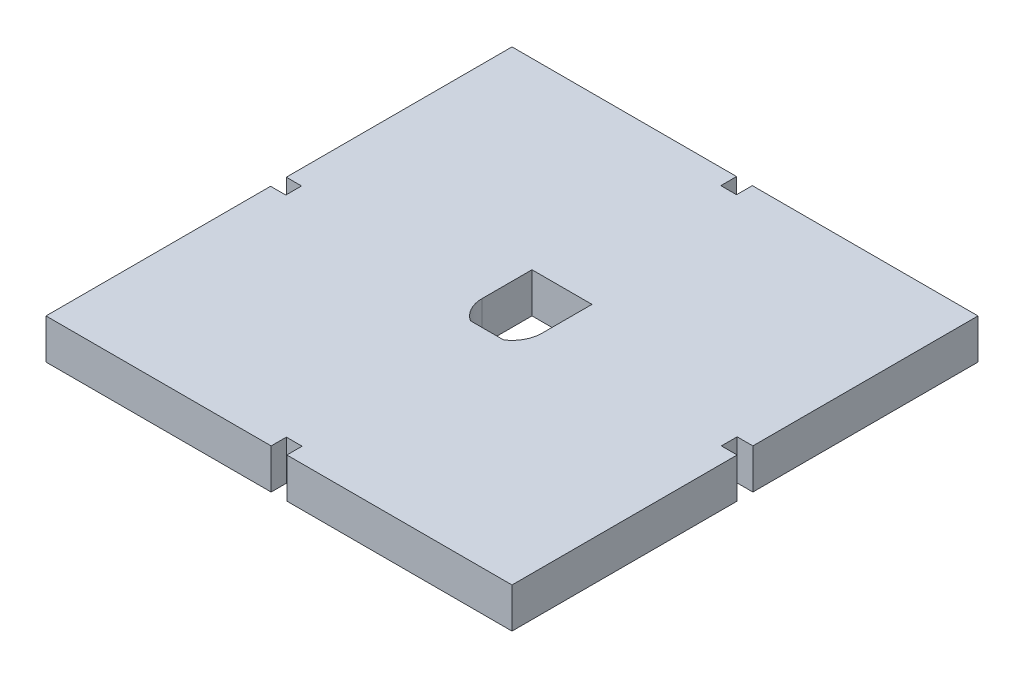
ISO-10303-21;
HEADER;
FILE_DESCRIPTION(('STEP AP214'),'2;1');
FILE_NAME('part.step','',(''),(''),'','','');
FILE_SCHEMA(('AUTOMOTIVE_DESIGN { 1 0 10303 214 1 1 1 1 }'));
ENDSEC;
DATA;
#1=APPLICATION_CONTEXT('core data for automotive mechanical design processes');
#2=APPLICATION_PROTOCOL_DEFINITION('international standard','automotive_design',2000,#1);
#3=PRODUCT_CONTEXT('',#1,'mechanical');
#4=PRODUCT('Part','Part','',(#3));
#5=PRODUCT_RELATED_PRODUCT_CATEGORY('part','',(#4));
#6=PRODUCT_DEFINITION_FORMATION('','',#4);
#7=PRODUCT_DEFINITION_CONTEXT('part definition',#1,'design');
#8=PRODUCT_DEFINITION('design','',#6,#7);
#9=PRODUCT_DEFINITION_SHAPE('','',#8);
#10=(LENGTH_UNIT() NAMED_UNIT(*) SI_UNIT(.MILLI.,.METRE.));
#11=(NAMED_UNIT(*) PLANE_ANGLE_UNIT() SI_UNIT($,.RADIAN.));
#12=(NAMED_UNIT(*) SI_UNIT($,.STERADIAN.) SOLID_ANGLE_UNIT());
#13=UNCERTAINTY_MEASURE_WITH_UNIT(LENGTH_MEASURE(1.E-05),#10,'distance_accuracy_value','');
#14=(GEOMETRIC_REPRESENTATION_CONTEXT(3) GLOBAL_UNCERTAINTY_ASSIGNED_CONTEXT((#13)) GLOBAL_UNIT_ASSIGNED_CONTEXT((#10,
#11,#12)) REPRESENTATION_CONTEXT('',''));
#15=CARTESIAN_POINT('',(0.,0.,0.));
#16=DIRECTION('',(0.,0.,1.));
#17=DIRECTION('',(1.,0.,0.));
#18=AXIS2_PLACEMENT_3D('',#15,#16,#17);
#19=CARTESIAN_POINT('',(0.,12.7,0.));
#20=DIRECTION('',(1.,0.,0.));
#21=DIRECTION('',(0.,0.,-1.));
#22=AXIS2_PLACEMENT_3D('',#19,#20,#21);
#23=PLANE('',#22);
#24=DIRECTION('',(0.,0.,1.));
#25=VECTOR('',#24,1.);
#26=CARTESIAN_POINT('',(0.,0.,0.));
#27=LINE('',#26,#25);
#28=CARTESIAN_POINT('',(0.,0.,-148.));
#29=VERTEX_POINT('',#28);
#30=CARTESIAN_POINT('',(0.,0.,-76.3207871455941));
#31=VERTEX_POINT('',#30);
#32=EDGE_CURVE('E438',#29,#31,#27,.T.);
#33=ORIENTED_EDGE('',*,*,#32,.T.);
#34=DIRECTION('',(0.,1.,0.));
#35=VECTOR('',#34,1.);
#36=CARTESIAN_POINT('',(0.,12.7,-76.3207871455941));
#37=LINE('',#36,#35);
#38=CARTESIAN_POINT('',(0.,12.7,-76.3207871455941));
#39=VERTEX_POINT('',#38);
#40=EDGE_CURVE('E308',#31,#39,#37,.T.);
#41=ORIENTED_EDGE('',*,*,#40,.T.);
#42=DIRECTION('',(0.,0.,1.));
#43=VECTOR('',#42,1.);
#44=CARTESIAN_POINT('',(0.,12.7,0.));
#45=LINE('',#44,#43);
#46=CARTESIAN_POINT('',(0.,12.7,-148.));
#47=VERTEX_POINT('',#46);
#48=EDGE_CURVE('E417',#47,#39,#45,.T.);
#49=ORIENTED_EDGE('',*,*,#48,.F.);
#50=DIRECTION('',(0.,-1.,0.));
#51=VECTOR('',#50,1.);
#52=CARTESIAN_POINT('',(0.,12.7,-148.));
#53=LINE('',#52,#51);
#54=EDGE_CURVE('E437',#47,#29,#53,.T.);
#55=ORIENTED_EDGE('',*,*,#54,.T.);
#56=EDGE_LOOP('',(#33,#41,#49,#55));
#57=FACE_BOUND('',#56,.T.);
#58=ADVANCED_FACE('F39',(#57),#23,.F.);
#59=CARTESIAN_POINT('',(0.,12.7,0.));
#60=DIRECTION('',(0.,0.,-1.));
#61=DIRECTION('',(-1.,0.,0.));
#62=AXIS2_PLACEMENT_3D('',#59,#60,#61);
#63=PLANE('',#62);
#64=DIRECTION('',(1.,0.,0.));
#65=VECTOR('',#64,1.);
#66=CARTESIAN_POINT('',(0.,0.,0.));
#67=LINE('',#66,#65);
#68=CARTESIAN_POINT('',(0.,0.,0.));
#69=VERTEX_POINT('',#68);
#70=CARTESIAN_POINT('',(71.5062552749679,0.,0.));
#71=VERTEX_POINT('',#70);
#72=EDGE_CURVE('E443',#69,#71,#67,.T.);
#73=ORIENTED_EDGE('',*,*,#72,.T.);
#74=DIRECTION('',(0.,1.,0.));
#75=VECTOR('',#74,1.);
#76=CARTESIAN_POINT('',(71.5062552749679,12.7,0.));
#77=LINE('',#76,#75);
#78=CARTESIAN_POINT('',(71.5062552749679,12.7,0.));
#79=VERTEX_POINT('',#78);
#80=EDGE_CURVE('E300',#71,#79,#77,.T.);
#81=ORIENTED_EDGE('',*,*,#80,.T.);
#82=DIRECTION('',(1.,0.,0.));
#83=VECTOR('',#82,1.);
#84=CARTESIAN_POINT('',(0.,12.7,0.));
#85=LINE('',#84,#83);
#86=CARTESIAN_POINT('',(0.,12.7,0.));
#87=VERTEX_POINT('',#86);
#88=EDGE_CURVE('E423',#87,#79,#85,.T.);
#89=ORIENTED_EDGE('',*,*,#88,.F.);
#90=DIRECTION('',(0.,-1.,0.));
#91=VECTOR('',#90,1.);
#92=CARTESIAN_POINT('',(0.,12.7,0.));
#93=LINE('',#92,#91);
#94=EDGE_CURVE('E467',#87,#69,#93,.T.);
#95=ORIENTED_EDGE('',*,*,#94,.T.);
#96=EDGE_LOOP('',(#73,#81,#89,#95));
#97=FACE_BOUND('',#96,.T.);
#98=ADVANCED_FACE('F521',(#97),#63,.F.);
#99=CARTESIAN_POINT('',(0.,12.7,-148.));
#100=DIRECTION('',(0.,0.,1.));
#101=DIRECTION('',(1.,0.,0.));
#102=AXIS2_PLACEMENT_3D('',#99,#100,#101);
#103=PLANE('',#102);
#104=DIRECTION('',(-1.,0.,0.));
#105=VECTOR('',#104,1.);
#106=CARTESIAN_POINT('',(0.,0.,-148.));
#107=LINE('',#106,#105);
#108=CARTESIAN_POINT('',(148.,0.,-148.));
#109=VERTEX_POINT('',#108);
#110=CARTESIAN_POINT('',(76.3270424205609,0.,-148.));
#111=VERTEX_POINT('',#110);
#112=EDGE_CURVE('E453',#109,#111,#107,.T.);
#113=ORIENTED_EDGE('',*,*,#112,.T.);
#114=DIRECTION('',(0.,1.,0.));
#115=VECTOR('',#114,1.);
#116=CARTESIAN_POINT('',(76.3270424205609,12.7,-148.));
#117=LINE('',#116,#115);
#118=CARTESIAN_POINT('',(76.3270424205609,12.7,-148.));
#119=VERTEX_POINT('',#118);
#120=EDGE_CURVE('E227',#111,#119,#117,.T.);
#121=ORIENTED_EDGE('',*,*,#120,.T.);
#122=DIRECTION('',(-1.,0.,0.));
#123=VECTOR('',#122,1.);
#124=CARTESIAN_POINT('',(0.,12.7,-148.));
#125=LINE('',#124,#123);
#126=CARTESIAN_POINT('',(148.,12.7,-148.));
#127=VERTEX_POINT('',#126);
#128=EDGE_CURVE('E433',#127,#119,#125,.T.);
#129=ORIENTED_EDGE('',*,*,#128,.F.);
#130=DIRECTION('',(0.,-1.,0.));
#131=VECTOR('',#130,1.);
#132=CARTESIAN_POINT('',(148.,12.7,-148.));
#133=LINE('',#132,#131);
#134=EDGE_CURVE('E459',#127,#109,#133,.T.);
#135=ORIENTED_EDGE('',*,*,#134,.T.);
#136=EDGE_LOOP('',(#113,#121,#129,#135));
#137=FACE_BOUND('',#136,.T.);
#138=ADVANCED_FACE('F525',(#137),#103,.F.);
#139=CARTESIAN_POINT('',(148.,12.7,0.));
#140=DIRECTION('',(-1.,0.,0.));
#141=DIRECTION('',(0.,0.,1.));
#142=AXIS2_PLACEMENT_3D('',#139,#140,#141);
#143=PLANE('',#142);
#144=DIRECTION('',(0.,0.,-1.));
#145=VECTOR('',#144,1.);
#146=CARTESIAN_POINT('',(148.,0.,0.));
#147=LINE('',#146,#145);
#148=CARTESIAN_POINT('',(148.,0.,0.));
#149=VERTEX_POINT('',#148);
#150=CARTESIAN_POINT('',(148.,0.,-71.5));
#151=VERTEX_POINT('',#150);
#152=EDGE_CURVE('E448',#149,#151,#147,.T.);
#153=ORIENTED_EDGE('',*,*,#152,.T.);
#154=DIRECTION('',(0.,1.,0.));
#155=VECTOR('',#154,1.);
#156=CARTESIAN_POINT('',(148.,12.7,-71.5));
#157=LINE('',#156,#155);
#158=CARTESIAN_POINT('',(148.,12.7,-71.5));
#159=VERTEX_POINT('',#158);
#160=EDGE_CURVE('E347',#151,#159,#157,.T.);
#161=ORIENTED_EDGE('',*,*,#160,.T.);
#162=DIRECTION('',(0.,0.,-1.));
#163=VECTOR('',#162,1.);
#164=CARTESIAN_POINT('',(148.,12.7,0.));
#165=LINE('',#164,#163);
#166=CARTESIAN_POINT('',(148.,12.7,0.));
#167=VERTEX_POINT('',#166);
#168=EDGE_CURVE('E428',#167,#159,#165,.T.);
#169=ORIENTED_EDGE('',*,*,#168,.F.);
#170=DIRECTION('',(0.,-1.,0.));
#171=VECTOR('',#170,1.);
#172=CARTESIAN_POINT('',(148.,12.7,0.));
#173=LINE('',#172,#171);
#174=EDGE_CURVE('E463',#167,#149,#173,.T.);
#175=ORIENTED_EDGE('',*,*,#174,.T.);
#176=EDGE_LOOP('',(#153,#161,#169,#175));
#177=FACE_BOUND('',#176,.T.);
#178=ADVANCED_FACE('F529',(#177),#143,.F.);
#179=CARTESIAN_POINT('',(0.,12.7,-71.3207871455941));
#180=VERTEX_POINT('',#179);
#181=EDGE_CURVE('E422',#180,#87,#45,.T.);
#182=ORIENTED_EDGE('',*,*,#181,.F.);
#183=DIRECTION('',(0.,-1.,0.));
#184=VECTOR('',#183,1.);
#185=CARTESIAN_POINT('',(0.,12.7,-71.3207871455941));
#186=LINE('',#185,#184);
#187=CARTESIAN_POINT('',(0.,0.,-71.3207871455941));
#188=VERTEX_POINT('',#187);
#189=EDGE_CURVE('E304',#180,#188,#186,.T.);
#190=ORIENTED_EDGE('',*,*,#189,.T.);
#191=EDGE_CURVE('E401',#188,#69,#27,.T.);
#192=ORIENTED_EDGE('',*,*,#191,.T.);
#193=ORIENTED_EDGE('',*,*,#94,.F.);
#194=EDGE_LOOP('',(#182,#190,#192,#193));
#195=FACE_BOUND('',#194,.T.);
#196=ADVANCED_FACE('F41',(#195),#23,.F.);
#197=CARTESIAN_POINT('',(76.5062552749679,12.7,0.));
#198=VERTEX_POINT('',#197);
#199=EDGE_CURVE('E421',#198,#167,#85,.T.);
#200=ORIENTED_EDGE('',*,*,#199,.F.);
#201=DIRECTION('',(0.,-1.,0.));
#202=VECTOR('',#201,1.);
#203=CARTESIAN_POINT('',(76.5062552749679,12.7,0.));
#204=LINE('',#203,#202);
#205=CARTESIAN_POINT('',(76.5062552749679,0.,0.));
#206=VERTEX_POINT('',#205);
#207=EDGE_CURVE('E220',#198,#206,#204,.T.);
#208=ORIENTED_EDGE('',*,*,#207,.T.);
#209=EDGE_CURVE('E442',#206,#149,#67,.T.);
#210=ORIENTED_EDGE('',*,*,#209,.T.);
#211=ORIENTED_EDGE('',*,*,#174,.F.);
#212=EDGE_LOOP('',(#200,#208,#210,#211));
#213=FACE_BOUND('',#212,.T.);
#214=ADVANCED_FACE('F527',(#213),#63,.F.);
#215=CARTESIAN_POINT('',(148.,12.7,-76.5));
#216=VERTEX_POINT('',#215);
#217=EDGE_CURVE('E427',#216,#127,#165,.T.);
#218=ORIENTED_EDGE('',*,*,#217,.F.);
#219=DIRECTION('',(0.,-1.,0.));
#220=VECTOR('',#219,1.);
#221=CARTESIAN_POINT('',(148.,12.7,-76.5));
#222=LINE('',#221,#220);
#223=CARTESIAN_POINT('',(148.,0.,-76.5));
#224=VERTEX_POINT('',#223);
#225=EDGE_CURVE('E340',#216,#224,#222,.T.);
#226=ORIENTED_EDGE('',*,*,#225,.T.);
#227=EDGE_CURVE('E447',#224,#109,#147,.T.);
#228=ORIENTED_EDGE('',*,*,#227,.T.);
#229=ORIENTED_EDGE('',*,*,#134,.F.);
#230=EDGE_LOOP('',(#218,#226,#228,#229));
#231=FACE_BOUND('',#230,.T.);
#232=ADVANCED_FACE('F534',(#231),#143,.F.);
#233=CARTESIAN_POINT('',(71.3270424205609,12.7,-148.));
#234=VERTEX_POINT('',#233);
#235=EDGE_CURVE('E432',#234,#47,#125,.T.);
#236=ORIENTED_EDGE('',*,*,#235,.F.);
#237=DIRECTION('',(0.,-1.,0.));
#238=VECTOR('',#237,1.);
#239=CARTESIAN_POINT('',(71.3270424205609,12.7,-148.));
#240=LINE('',#239,#238);
#241=CARTESIAN_POINT('',(71.3270424205609,0.,-148.));
#242=VERTEX_POINT('',#241);
#243=EDGE_CURVE('E312',#234,#242,#240,.T.);
#244=ORIENTED_EDGE('',*,*,#243,.T.);
#245=EDGE_CURVE('E452',#242,#29,#107,.T.);
#246=ORIENTED_EDGE('',*,*,#245,.T.);
#247=ORIENTED_EDGE('',*,*,#54,.F.);
#248=EDGE_LOOP('',(#236,#244,#246,#247));
#249=FACE_BOUND('',#248,.T.);
#250=ADVANCED_FACE('F502',(#249),#103,.F.);
#251=CARTESIAN_POINT('',(0.,12.7,0.));
#252=DIRECTION('',(0.,-1.,0.));
#253=DIRECTION('',(0.,0.,-1.));
#254=AXIS2_PLACEMENT_3D('',#251,#252,#253);
#255=PLANE('',#254);
#256=DIRECTION('',(1.,0.,0.));
#257=VECTOR('',#256,1.);
#258=CARTESIAN_POINT('',(0.,12.7,-66.0625));
#259=LINE('',#258,#257);
#260=CARTESIAN_POINT('',(68.7348581453108,12.7,-66.0625));
#261=VERTEX_POINT('',#260);
#262=CARTESIAN_POINT('',(79.2651418546892,12.7,-66.0625));
#263=VERTEX_POINT('',#262);
#264=EDGE_CURVE('E379',#261,#263,#259,.T.);
#265=ORIENTED_EDGE('',*,*,#264,.F.);
#266=CARTESIAN_POINT('',(74.,12.7,-74.));
#267=DIRECTION('',(0.,1.,0.));
#268=DIRECTION('',(0.,0.,1.));
#269=AXIS2_PLACEMENT_3D('',#266,#267,#268);
#270=CIRCLE('',#269,9.52500000000001);
#271=CARTESIAN_POINT('',(64.475,12.7,-74.));
#272=VERTEX_POINT('',#271);
#273=EDGE_CURVE('E351',#272,#261,#270,.T.);
#274=ORIENTED_EDGE('',*,*,#273,.F.);
#275=DIRECTION('',(0.,0.,-1.));
#276=VECTOR('',#275,1.);
#277=CARTESIAN_POINT('',(64.475,12.7,0.));
#278=LINE('',#277,#276);
#279=CARTESIAN_POINT('',(64.475,12.7,-89.875));
#280=VERTEX_POINT('',#279);
#281=EDGE_CURVE('E357',#272,#280,#278,.T.);
#282=ORIENTED_EDGE('',*,*,#281,.T.);
#283=DIRECTION('',(-1.,0.,0.));
#284=VECTOR('',#283,1.);
#285=CARTESIAN_POINT('',(0.,12.7,-89.875));
#286=LINE('',#285,#284);
#287=CARTESIAN_POINT('',(83.525,12.7,-89.875));
#288=VERTEX_POINT('',#287);
#289=EDGE_CURVE('E391',#288,#280,#286,.T.);
#290=ORIENTED_EDGE('',*,*,#289,.F.);
#291=DIRECTION('',(0.,0.,-1.));
#292=VECTOR('',#291,1.);
#293=CARTESIAN_POINT('',(83.525,12.7,0.));
#294=LINE('',#293,#292);
#295=CARTESIAN_POINT('',(83.525,12.7,-74.));
#296=VERTEX_POINT('',#295);
#297=EDGE_CURVE('E387',#296,#288,#294,.T.);
#298=ORIENTED_EDGE('',*,*,#297,.F.);
#299=CARTESIAN_POINT('',(74.,12.7,-74.));
#300=DIRECTION('',(0.,1.,0.));
#301=DIRECTION('',(0.,0.,1.));
#302=AXIS2_PLACEMENT_3D('',#299,#300,#301);
#303=CIRCLE('',#302,9.52500000000001);
#304=EDGE_CURVE('E383',#263,#296,#303,.T.);
#305=ORIENTED_EDGE('',*,*,#304,.F.);
#306=EDGE_LOOP('',(#265,#274,#282,#290,#298,#305));
#307=FACE_BOUND('',#306,.T.);
#308=ORIENTED_EDGE('',*,*,#128,.T.);
#309=DIRECTION('',(0.,0.,-1.));
#310=VECTOR('',#309,1.);
#311=CARTESIAN_POINT('',(76.3270424205609,12.7,-142.993744725033));
#312=LINE('',#311,#310);
#313=CARTESIAN_POINT('',(76.3270424205609,12.7,-142.993744725033));
#314=VERTEX_POINT('',#313);
#315=EDGE_CURVE('E238',#314,#119,#312,.T.);
#316=ORIENTED_EDGE('',*,*,#315,.F.);
#317=DIRECTION('',(1.,0.,0.));
#318=VECTOR('',#317,1.);
#319=CARTESIAN_POINT('',(76.3270424205609,12.7,-142.993744725033));
#320=LINE('',#319,#318);
#321=CARTESIAN_POINT('',(71.3270424205609,12.7,-142.993744725033));
#322=VERTEX_POINT('',#321);
#323=EDGE_CURVE('E216',#322,#314,#320,.T.);
#324=ORIENTED_EDGE('',*,*,#323,.F.);
#325=DIRECTION('',(0.,0.,1.));
#326=VECTOR('',#325,1.);
#327=CARTESIAN_POINT('',(71.3270424205609,12.7,-142.993744725033));
#328=LINE('',#327,#326);
#329=EDGE_CURVE('E243',#234,#322,#328,.T.);
#330=ORIENTED_EDGE('',*,*,#329,.F.);
#331=ORIENTED_EDGE('',*,*,#235,.T.);
#332=ORIENTED_EDGE('',*,*,#48,.T.);
#333=DIRECTION('',(-1.,0.,0.));
#334=VECTOR('',#333,1.);
#335=CARTESIAN_POINT('',(4.83329769552829,12.7,-76.3207871455941));
#336=LINE('',#335,#334);
#337=CARTESIAN_POINT('',(4.83329769552829,12.7,-76.3207871455941));
#338=VERTEX_POINT('',#337);
#339=EDGE_CURVE('E254',#338,#39,#336,.T.);
#340=ORIENTED_EDGE('',*,*,#339,.F.);
#341=DIRECTION('',(0.,0.,-1.));
#342=VECTOR('',#341,1.);
#343=CARTESIAN_POINT('',(4.83329769552829,12.7,-76.3207871455941));
#344=LINE('',#343,#342);
#345=CARTESIAN_POINT('',(4.83329769552829,12.7,-71.3207871455941));
#346=VERTEX_POINT('',#345);
#347=EDGE_CURVE('E262',#346,#338,#344,.T.);
#348=ORIENTED_EDGE('',*,*,#347,.F.);
#349=DIRECTION('',(1.,0.,0.));
#350=VECTOR('',#349,1.);
#351=CARTESIAN_POINT('',(4.83329769552829,12.7,-71.3207871455941));
#352=LINE('',#351,#350);
#353=EDGE_CURVE('E259',#180,#346,#352,.T.);
#354=ORIENTED_EDGE('',*,*,#353,.F.);
#355=ORIENTED_EDGE('',*,*,#181,.T.);
#356=ORIENTED_EDGE('',*,*,#88,.T.);
#357=DIRECTION('',(0.,0.,1.));
#358=VECTOR('',#357,1.);
#359=CARTESIAN_POINT('',(71.5062552749678,12.7,-4.82704242056115));
#360=LINE('',#359,#358);
#361=CARTESIAN_POINT('',(71.5062552749678,12.7,-4.82704242056115));
#362=VERTEX_POINT('',#361);
#363=EDGE_CURVE('E278',#362,#79,#360,.T.);
#364=ORIENTED_EDGE('',*,*,#363,.F.);
#365=DIRECTION('',(-1.,0.,0.));
#366=VECTOR('',#365,1.);
#367=CARTESIAN_POINT('',(71.5062552749678,12.7,-4.82704242056115));
#368=LINE('',#367,#366);
#369=CARTESIAN_POINT('',(76.5062552749678,12.7,-4.8270424205612));
#370=VERTEX_POINT('',#369);
#371=EDGE_CURVE('E286',#370,#362,#368,.T.);
#372=ORIENTED_EDGE('',*,*,#371,.F.);
#373=DIRECTION('',(0.,0.,-1.));
#374=VECTOR('',#373,1.);
#375=CARTESIAN_POINT('',(76.5062552749678,12.7,-4.8270424205612));
#376=LINE('',#375,#374);
#377=EDGE_CURVE('E283',#198,#370,#376,.T.);
#378=ORIENTED_EDGE('',*,*,#377,.F.);
#379=ORIENTED_EDGE('',*,*,#199,.T.);
#380=ORIENTED_EDGE('',*,*,#168,.T.);
#381=DIRECTION('',(1.,0.,0.));
#382=VECTOR('',#381,1.);
#383=CARTESIAN_POINT('',(143.,12.7,-71.5));
#384=LINE('',#383,#382);
#385=CARTESIAN_POINT('',(143.,12.7,-71.5));
#386=VERTEX_POINT('',#385);
#387=EDGE_CURVE('E324',#386,#159,#384,.T.);
#388=ORIENTED_EDGE('',*,*,#387,.F.);
#389=DIRECTION('',(0.,0.,1.));
#390=VECTOR('',#389,1.);
#391=CARTESIAN_POINT('',(143.,12.7,-71.5));
#392=LINE('',#391,#390);
#393=CARTESIAN_POINT('',(143.,12.7,-76.5));
#394=VERTEX_POINT('',#393);
#395=EDGE_CURVE('E331',#394,#386,#392,.T.);
#396=ORIENTED_EDGE('',*,*,#395,.F.);
#397=DIRECTION('',(-1.,0.,0.));
#398=VECTOR('',#397,1.);
#399=CARTESIAN_POINT('',(143.,12.7,-76.5));
#400=LINE('',#399,#398);
#401=EDGE_CURVE('E318',#216,#394,#400,.T.);
#402=ORIENTED_EDGE('',*,*,#401,.F.);
#403=ORIENTED_EDGE('',*,*,#217,.T.);
#404=EDGE_LOOP('',(#308,#316,#324,#330,#331,#332,#340,#348,#354,#355,#356,#364,#372,#378,#379,
#380,#388,#396,#402,#403));
#405=FACE_BOUND('',#404,.T.);
#406=ADVANCED_FACE('F498',(#307,#405),#255,.F.);
#407=CARTESIAN_POINT('',(0.,0.,0.));
#408=DIRECTION('',(0.,-1.,0.));
#409=DIRECTION('',(0.,0.,-1.));
#410=AXIS2_PLACEMENT_3D('',#407,#408,#409);
#411=PLANE('',#410);
#412=DIRECTION('',(0.,0.,-1.));
#413=VECTOR('',#412,1.);
#414=CARTESIAN_POINT('',(76.3270424205609,0.,-142.993744725033));
#415=LINE('',#414,#413);
#416=CARTESIAN_POINT('',(76.3270424205609,0.,-142.993744725033));
#417=VERTEX_POINT('',#416);
#418=EDGE_CURVE('E224',#417,#111,#415,.T.);
#419=ORIENTED_EDGE('',*,*,#418,.T.);
#420=ORIENTED_EDGE('',*,*,#112,.F.);
#421=ORIENTED_EDGE('',*,*,#227,.F.);
#422=DIRECTION('',(1.,0.,0.));
#423=VECTOR('',#422,1.);
#424=CARTESIAN_POINT('',(0.,0.,-76.5));
#425=LINE('',#424,#423);
#426=CARTESIAN_POINT('',(143.,0.,-76.5));
#427=VERTEX_POINT('',#426);
#428=EDGE_CURVE('E471',#427,#224,#425,.T.);
#429=ORIENTED_EDGE('',*,*,#428,.F.);
#430=DIRECTION('',(0.,0.,1.));
#431=VECTOR('',#430,1.);
#432=CARTESIAN_POINT('',(143.,0.,-71.5));
#433=LINE('',#432,#431);
#434=CARTESIAN_POINT('',(143.,0.,-71.5));
#435=VERTEX_POINT('',#434);
#436=EDGE_CURVE('E319',#427,#435,#433,.T.);
#437=ORIENTED_EDGE('',*,*,#436,.T.);
#438=DIRECTION('',(1.,0.,0.));
#439=VECTOR('',#438,1.);
#440=CARTESIAN_POINT('',(143.,0.,-71.5));
#441=LINE('',#440,#439);
#442=EDGE_CURVE('E323',#435,#151,#441,.T.);
#443=ORIENTED_EDGE('',*,*,#442,.T.);
#444=ORIENTED_EDGE('',*,*,#152,.F.);
#445=ORIENTED_EDGE('',*,*,#209,.F.);
#446=DIRECTION('',(0.,0.,1.));
#447=VECTOR('',#446,1.);
#448=CARTESIAN_POINT('',(76.5062552749679,0.,-8.01360487791958E-13));
#449=LINE('',#448,#447);
#450=CARTESIAN_POINT('',(76.5062552749678,0.,-4.8270424205612));
#451=VERTEX_POINT('',#450);
#452=EDGE_CURVE('E474',#451,#206,#449,.T.);
#453=ORIENTED_EDGE('',*,*,#452,.F.);
#454=DIRECTION('',(-1.,0.,0.));
#455=VECTOR('',#454,1.);
#456=CARTESIAN_POINT('',(71.5062552749678,0.,-4.82704242056115));
#457=LINE('',#456,#455);
#458=CARTESIAN_POINT('',(71.5062552749678,0.,-4.82704242056115));
#459=VERTEX_POINT('',#458);
#460=EDGE_CURVE('E273',#451,#459,#457,.T.);
#461=ORIENTED_EDGE('',*,*,#460,.T.);
#462=DIRECTION('',(0.,0.,1.));
#463=VECTOR('',#462,1.);
#464=CARTESIAN_POINT('',(71.5062552749678,0.,-4.82704242056115));
#465=LINE('',#464,#463);
#466=EDGE_CURVE('E277',#459,#71,#465,.T.);
#467=ORIENTED_EDGE('',*,*,#466,.T.);
#468=ORIENTED_EDGE('',*,*,#72,.F.);
#469=ORIENTED_EDGE('',*,*,#191,.F.);
#470=DIRECTION('',(-1.,0.,0.));
#471=VECTOR('',#470,1.);
#472=CARTESIAN_POINT('',(0.,0.,-71.3207871455941));
#473=LINE('',#472,#471);
#474=CARTESIAN_POINT('',(4.83329769552829,0.,-71.3207871455941));
#475=VERTEX_POINT('',#474);
#476=EDGE_CURVE('E48',#475,#188,#473,.T.);
#477=ORIENTED_EDGE('',*,*,#476,.F.);
#478=DIRECTION('',(0.,0.,-1.));
#479=VECTOR('',#478,1.);
#480=CARTESIAN_POINT('',(4.83329769552829,0.,-76.3207871455941));
#481=LINE('',#480,#479);
#482=CARTESIAN_POINT('',(4.83329769552829,0.,-76.3207871455941));
#483=VERTEX_POINT('',#482);
#484=EDGE_CURVE('E63',#475,#483,#481,.T.);
#485=ORIENTED_EDGE('',*,*,#484,.T.);
#486=DIRECTION('',(-1.,0.,0.));
#487=VECTOR('',#486,1.);
#488=CARTESIAN_POINT('',(4.83329769552829,0.,-76.3207871455941));
#489=LINE('',#488,#487);
#490=EDGE_CURVE('E253',#483,#31,#489,.T.);
#491=ORIENTED_EDGE('',*,*,#490,.T.);
#492=ORIENTED_EDGE('',*,*,#32,.F.);
#493=ORIENTED_EDGE('',*,*,#245,.F.);
#494=DIRECTION('',(0.,0.,-1.));
#495=VECTOR('',#494,1.);
#496=CARTESIAN_POINT('',(71.3270424205614,0.,-2.49037037566263E-13));
#497=LINE('',#496,#495);
#498=CARTESIAN_POINT('',(71.3270424205609,0.,-142.993744725033));
#499=VERTEX_POINT('',#498);
#500=EDGE_CURVE('E11',#499,#242,#497,.T.);
#501=ORIENTED_EDGE('',*,*,#500,.F.);
#502=DIRECTION('',(1.,0.,0.));
#503=VECTOR('',#502,1.);
#504=CARTESIAN_POINT('',(76.3270424205609,0.,-142.993744725033));
#505=LINE('',#504,#503);
#506=EDGE_CURVE('E55',#499,#417,#505,.T.);
#507=ORIENTED_EDGE('',*,*,#506,.T.);
#508=EDGE_LOOP('',(#419,#420,#421,#429,#437,#443,#444,#445,#453,#461,#467,#468,#469,#477,#485,
#491,#492,#493,#501,#507));
#509=FACE_BOUND('',#508,.T.);
#510=CARTESIAN_POINT('',(74.,0.,-74.));
#511=DIRECTION('',(0.,1.,0.));
#512=DIRECTION('',(0.,0.,1.));
#513=AXIS2_PLACEMENT_3D('',#510,#511,#512);
#514=CIRCLE('',#513,9.52500000000001);
#515=CARTESIAN_POINT('',(64.475,0.,-74.));
#516=VERTEX_POINT('',#515);
#517=CARTESIAN_POINT('',(68.7348581453108,0.,-66.0625));
#518=VERTEX_POINT('',#517);
#519=EDGE_CURVE('E352',#516,#518,#514,.T.);
#520=ORIENTED_EDGE('',*,*,#519,.T.);
#521=DIRECTION('',(1.,0.,0.));
#522=VECTOR('',#521,1.);
#523=CARTESIAN_POINT('',(0.,0.,-66.0625));
#524=LINE('',#523,#522);
#525=CARTESIAN_POINT('',(79.2651418546892,0.,-66.0625));
#526=VERTEX_POINT('',#525);
#527=EDGE_CURVE('E356',#518,#526,#524,.T.);
#528=ORIENTED_EDGE('',*,*,#527,.T.);
#529=CARTESIAN_POINT('',(74.,0.,-74.));
#530=DIRECTION('',(0.,1.,0.));
#531=DIRECTION('',(0.,0.,1.));
#532=AXIS2_PLACEMENT_3D('',#529,#530,#531);
#533=CIRCLE('',#532,9.52500000000001);
#534=CARTESIAN_POINT('',(83.525,0.,-74.));
#535=VERTEX_POINT('',#534);
#536=EDGE_CURVE('E361',#526,#535,#533,.T.);
#537=ORIENTED_EDGE('',*,*,#536,.T.);
#538=DIRECTION('',(0.,0.,-1.));
#539=VECTOR('',#538,1.);
#540=CARTESIAN_POINT('',(83.525,0.,0.));
#541=LINE('',#540,#539);
#542=CARTESIAN_POINT('',(83.525,0.,-89.875));
#543=VERTEX_POINT('',#542);
#544=EDGE_CURVE('E365',#535,#543,#541,.T.);
#545=ORIENTED_EDGE('',*,*,#544,.T.);
#546=DIRECTION('',(-1.,0.,0.));
#547=VECTOR('',#546,1.);
#548=CARTESIAN_POINT('',(0.,0.,-89.875));
#549=LINE('',#548,#547);
#550=CARTESIAN_POINT('',(64.475,0.,-89.875));
#551=VERTEX_POINT('',#550);
#552=EDGE_CURVE('E369',#543,#551,#549,.T.);
#553=ORIENTED_EDGE('',*,*,#552,.T.);
#554=DIRECTION('',(0.,0.,-1.));
#555=VECTOR('',#554,1.);
#556=CARTESIAN_POINT('',(64.475,0.,0.));
#557=LINE('',#556,#555);
#558=EDGE_CURVE('E373',#516,#551,#557,.T.);
#559=ORIENTED_EDGE('',*,*,#558,.F.);
#560=EDGE_LOOP('',(#520,#528,#537,#545,#553,#559));
#561=FACE_BOUND('',#560,.T.);
#562=ADVANCED_FACE('F234',(#509,#561),#411,.T.);
#563=CARTESIAN_POINT('',(74.,0.,-74.));
#564=DIRECTION('',(0.,1.,0.));
#565=DIRECTION('',(0.,0.,1.));
#566=AXIS2_PLACEMENT_3D('',#563,#564,#565);
#567=CYLINDRICAL_SURFACE('',#566,9.52500000000001);
#568=ORIENTED_EDGE('',*,*,#273,.T.);
#569=DIRECTION('',(0.,1.,0.));
#570=VECTOR('',#569,1.);
#571=CARTESIAN_POINT('',(68.7348581453108,0.,-66.0625));
#572=LINE('',#571,#570);
#573=EDGE_CURVE('E376',#518,#261,#572,.T.);
#574=ORIENTED_EDGE('',*,*,#573,.F.);
#575=ORIENTED_EDGE('',*,*,#519,.F.);
#576=DIRECTION('',(0.,1.,0.));
#577=VECTOR('',#576,1.);
#578=CARTESIAN_POINT('',(64.475,0.,-74.));
#579=LINE('',#578,#577);
#580=EDGE_CURVE('E398',#516,#272,#579,.T.);
#581=ORIENTED_EDGE('',*,*,#580,.T.);
#582=EDGE_LOOP('',(#568,#574,#575,#581));
#583=FACE_BOUND('',#582,.T.);
#584=ADVANCED_FACE('F602',(#583),#567,.F.);
#585=CARTESIAN_POINT('',(64.475,0.,0.));
#586=DIRECTION('',(1.,0.,0.));
#587=DIRECTION('',(0.,0.,-1.));
#588=AXIS2_PLACEMENT_3D('',#585,#586,#587);
#589=PLANE('',#588);
#590=ORIENTED_EDGE('',*,*,#281,.F.);
#591=ORIENTED_EDGE('',*,*,#580,.F.);
#592=ORIENTED_EDGE('',*,*,#558,.T.);
#593=DIRECTION('',(0.,1.,0.));
#594=VECTOR('',#593,1.);
#595=CARTESIAN_POINT('',(64.475,0.,-89.875));
#596=LINE('',#595,#594);
#597=EDGE_CURVE('E402',#551,#280,#596,.T.);
#598=ORIENTED_EDGE('',*,*,#597,.T.);
#599=EDGE_LOOP('',(#590,#591,#592,#598));
#600=FACE_BOUND('',#599,.T.);
#601=ADVANCED_FACE('F598',(#600),#589,.T.);
#602=CARTESIAN_POINT('',(0.,0.,-89.875));
#603=DIRECTION('',(0.,0.,-1.));
#604=DIRECTION('',(-1.,0.,0.));
#605=AXIS2_PLACEMENT_3D('',#602,#603,#604);
#606=PLANE('',#605);
#607=ORIENTED_EDGE('',*,*,#289,.T.);
#608=ORIENTED_EDGE('',*,*,#597,.F.);
#609=ORIENTED_EDGE('',*,*,#552,.F.);
#610=DIRECTION('',(0.,1.,0.));
#611=VECTOR('',#610,1.);
#612=CARTESIAN_POINT('',(83.525,0.,-89.875));
#613=LINE('',#612,#611);
#614=EDGE_CURVE('E405',#543,#288,#613,.T.);
#615=ORIENTED_EDGE('',*,*,#614,.T.);
#616=EDGE_LOOP('',(#607,#608,#609,#615));
#617=FACE_BOUND('',#616,.T.);
#618=ADVANCED_FACE('F601',(#617),#606,.F.);
#619=CARTESIAN_POINT('',(83.525,0.,0.));
#620=DIRECTION('',(1.,0.,0.));
#621=DIRECTION('',(0.,0.,-1.));
#622=AXIS2_PLACEMENT_3D('',#619,#620,#621);
#623=PLANE('',#622);
#624=ORIENTED_EDGE('',*,*,#297,.T.);
#625=ORIENTED_EDGE('',*,*,#614,.F.);
#626=ORIENTED_EDGE('',*,*,#544,.F.);
#627=DIRECTION('',(0.,1.,0.));
#628=VECTOR('',#627,1.);
#629=CARTESIAN_POINT('',(83.525,0.,-74.));
#630=LINE('',#629,#628);
#631=EDGE_CURVE('E408',#535,#296,#630,.T.);
#632=ORIENTED_EDGE('',*,*,#631,.T.);
#633=EDGE_LOOP('',(#624,#625,#626,#632));
#634=FACE_BOUND('',#633,.T.);
#635=ADVANCED_FACE('F606',(#634),#623,.F.);
#636=CARTESIAN_POINT('',(74.,0.,-74.));
#637=DIRECTION('',(0.,1.,0.));
#638=DIRECTION('',(0.,0.,1.));
#639=AXIS2_PLACEMENT_3D('',#636,#637,#638);
#640=CYLINDRICAL_SURFACE('',#639,9.52500000000001);
#641=ORIENTED_EDGE('',*,*,#304,.T.);
#642=ORIENTED_EDGE('',*,*,#631,.F.);
#643=ORIENTED_EDGE('',*,*,#536,.F.);
#644=DIRECTION('',(0.,1.,0.));
#645=VECTOR('',#644,1.);
#646=CARTESIAN_POINT('',(79.2651418546892,0.,-66.0625));
#647=LINE('',#646,#645);
#648=EDGE_CURVE('E411',#526,#263,#647,.T.);
#649=ORIENTED_EDGE('',*,*,#648,.T.);
#650=EDGE_LOOP('',(#641,#642,#643,#649));
#651=FACE_BOUND('',#650,.T.);
#652=ADVANCED_FACE('F610',(#651),#640,.F.);
#653=CARTESIAN_POINT('',(0.,0.,-66.0625));
#654=DIRECTION('',(0.,0.,1.));
#655=DIRECTION('',(1.,0.,0.));
#656=AXIS2_PLACEMENT_3D('',#653,#654,#655);
#657=PLANE('',#656);
#658=ORIENTED_EDGE('',*,*,#264,.T.);
#659=ORIENTED_EDGE('',*,*,#648,.F.);
#660=ORIENTED_EDGE('',*,*,#527,.F.);
#661=ORIENTED_EDGE('',*,*,#573,.T.);
#662=EDGE_LOOP('',(#658,#659,#660,#661));
#663=FACE_BOUND('',#662,.T.);
#664=ADVANCED_FACE('F594',(#663),#657,.F.);
#665=CARTESIAN_POINT('',(143.,0.,-71.5));
#666=DIRECTION('',(0.,0.,1.));
#667=DIRECTION('',(1.,0.,0.));
#668=AXIS2_PLACEMENT_3D('',#665,#666,#667);
#669=PLANE('',#668);
#670=ORIENTED_EDGE('',*,*,#442,.F.);
#671=DIRECTION('',(0.,1.,0.));
#672=VECTOR('',#671,1.);
#673=CARTESIAN_POINT('',(143.,0.,-71.5));
#674=LINE('',#673,#672);
#675=EDGE_CURVE('E337',#435,#386,#674,.T.);
#676=ORIENTED_EDGE('',*,*,#675,.T.);
#677=ORIENTED_EDGE('',*,*,#387,.T.);
#678=ORIENTED_EDGE('',*,*,#160,.F.);
#679=EDGE_LOOP('',(#670,#676,#677,#678));
#680=FACE_BOUND('',#679,.T.);
#681=ADVANCED_FACE('F592',(#680),#669,.F.);
#682=CARTESIAN_POINT('',(143.,0.,-76.5));
#683=DIRECTION('',(0.,0.,-1.));
#684=DIRECTION('',(-1.,0.,0.));
#685=AXIS2_PLACEMENT_3D('',#682,#683,#684);
#686=PLANE('',#685);
#687=ORIENTED_EDGE('',*,*,#401,.T.);
#688=DIRECTION('',(0.,1.,0.));
#689=VECTOR('',#688,1.);
#690=CARTESIAN_POINT('',(143.,0.,-76.5));
#691=LINE('',#690,#689);
#692=EDGE_CURVE('E328',#427,#394,#691,.T.);
#693=ORIENTED_EDGE('',*,*,#692,.F.);
#694=ORIENTED_EDGE('',*,*,#428,.T.);
#695=ORIENTED_EDGE('',*,*,#225,.F.);
#696=EDGE_LOOP('',(#687,#693,#694,#695));
#697=FACE_BOUND('',#696,.T.);
#698=ADVANCED_FACE('F557',(#697),#686,.F.);
#699=CARTESIAN_POINT('',(143.,0.,-71.5));
#700=DIRECTION('',(-1.,0.,0.));
#701=DIRECTION('',(0.,0.,1.));
#702=AXIS2_PLACEMENT_3D('',#699,#700,#701);
#703=PLANE('',#702);
#704=ORIENTED_EDGE('',*,*,#395,.T.);
#705=ORIENTED_EDGE('',*,*,#675,.F.);
#706=ORIENTED_EDGE('',*,*,#436,.F.);
#707=ORIENTED_EDGE('',*,*,#692,.T.);
#708=EDGE_LOOP('',(#704,#705,#706,#707));
#709=FACE_BOUND('',#708,.T.);
#710=ADVANCED_FACE('F560',(#709),#703,.F.);
#711=CARTESIAN_POINT('',(71.5062552749678,0.,-4.82704242056115));
#712=DIRECTION('',(-1.,0.,0.));
#713=DIRECTION('',(0.,0.,1.));
#714=AXIS2_PLACEMENT_3D('',#711,#712,#713);
#715=PLANE('',#714);
#716=ORIENTED_EDGE('',*,*,#466,.F.);
#717=DIRECTION('',(0.,1.,0.));
#718=VECTOR('',#717,1.);
#719=CARTESIAN_POINT('',(71.5062552749678,0.,-4.82704242056115));
#720=LINE('',#719,#718);
#721=EDGE_CURVE('E263',#459,#362,#720,.T.);
#722=ORIENTED_EDGE('',*,*,#721,.T.);
#723=ORIENTED_EDGE('',*,*,#363,.T.);
#724=ORIENTED_EDGE('',*,*,#80,.F.);
#725=EDGE_LOOP('',(#716,#722,#723,#724));
#726=FACE_BOUND('',#725,.T.);
#727=ADVANCED_FACE('F580',(#726),#715,.F.);
#728=CARTESIAN_POINT('',(76.5062552749678,0.,-4.8270424205612));
#729=DIRECTION('',(1.,0.,0.));
#730=DIRECTION('',(0.,0.,-1.));
#731=AXIS2_PLACEMENT_3D('',#728,#729,#730);
#732=PLANE('',#731);
#733=ORIENTED_EDGE('',*,*,#377,.T.);
#734=DIRECTION('',(0.,1.,0.));
#735=VECTOR('',#734,1.);
#736=CARTESIAN_POINT('',(76.5062552749678,0.,-4.8270424205612));
#737=LINE('',#736,#735);
#738=EDGE_CURVE('E282',#451,#370,#737,.T.);
#739=ORIENTED_EDGE('',*,*,#738,.F.);
#740=ORIENTED_EDGE('',*,*,#452,.T.);
#741=ORIENTED_EDGE('',*,*,#207,.F.);
#742=EDGE_LOOP('',(#733,#739,#740,#741));
#743=FACE_BOUND('',#742,.T.);
#744=ADVANCED_FACE('F571',(#743),#732,.F.);
#745=CARTESIAN_POINT('',(71.5062552749678,0.,-4.82704242056115));
#746=DIRECTION('',(0.,0.,-1.));
#747=DIRECTION('',(-1.,0.,0.));
#748=AXIS2_PLACEMENT_3D('',#745,#746,#747);
#749=PLANE('',#748);
#750=ORIENTED_EDGE('',*,*,#371,.T.);
#751=ORIENTED_EDGE('',*,*,#721,.F.);
#752=ORIENTED_EDGE('',*,*,#460,.F.);
#753=ORIENTED_EDGE('',*,*,#738,.T.);
#754=EDGE_LOOP('',(#750,#751,#752,#753));
#755=FACE_BOUND('',#754,.T.);
#756=ADVANCED_FACE('F575',(#755),#749,.F.);
#757=CARTESIAN_POINT('',(4.83329769552829,0.,-76.3207871455941));
#758=DIRECTION('',(0.,0.,-1.));
#759=DIRECTION('',(-1.,0.,0.));
#760=AXIS2_PLACEMENT_3D('',#757,#758,#759);
#761=PLANE('',#760);
#762=ORIENTED_EDGE('',*,*,#490,.F.);
#763=DIRECTION('',(0.,1.,0.));
#764=VECTOR('',#763,1.);
#765=CARTESIAN_POINT('',(4.83329769552829,0.,-76.3207871455941));
#766=LINE('',#765,#764);
#767=EDGE_CURVE('E246',#483,#338,#766,.T.);
#768=ORIENTED_EDGE('',*,*,#767,.T.);
#769=ORIENTED_EDGE('',*,*,#339,.T.);
#770=ORIENTED_EDGE('',*,*,#40,.F.);
#771=EDGE_LOOP('',(#762,#768,#769,#770));
#772=FACE_BOUND('',#771,.T.);
#773=ADVANCED_FACE('F507',(#772),#761,.F.);
#774=CARTESIAN_POINT('',(4.83329769552829,0.,-71.3207871455941));
#775=DIRECTION('',(0.,0.,1.));
#776=DIRECTION('',(1.,0.,0.));
#777=AXIS2_PLACEMENT_3D('',#774,#775,#776);
#778=PLANE('',#777);
#779=ORIENTED_EDGE('',*,*,#353,.T.);
#780=DIRECTION('',(0.,1.,0.));
#781=VECTOR('',#780,1.);
#782=CARTESIAN_POINT('',(4.83329769552829,0.,-71.3207871455941));
#783=LINE('',#782,#781);
#784=EDGE_CURVE('E258',#475,#346,#783,.T.);
#785=ORIENTED_EDGE('',*,*,#784,.F.);
#786=ORIENTED_EDGE('',*,*,#476,.T.);
#787=ORIENTED_EDGE('',*,*,#189,.F.);
#788=EDGE_LOOP('',(#779,#785,#786,#787));
#789=FACE_BOUND('',#788,.T.);
#790=ADVANCED_FACE('F479',(#789),#778,.F.);
#791=CARTESIAN_POINT('',(4.83329769552829,0.,-76.3207871455941));
#792=DIRECTION('',(1.,0.,0.));
#793=DIRECTION('',(0.,0.,-1.));
#794=AXIS2_PLACEMENT_3D('',#791,#792,#793);
#795=PLANE('',#794);
#796=ORIENTED_EDGE('',*,*,#347,.T.);
#797=ORIENTED_EDGE('',*,*,#767,.F.);
#798=ORIENTED_EDGE('',*,*,#484,.F.);
#799=ORIENTED_EDGE('',*,*,#784,.T.);
#800=EDGE_LOOP('',(#796,#797,#798,#799));
#801=FACE_BOUND('',#800,.T.);
#802=ADVANCED_FACE('F509',(#801),#795,.F.);
#803=CARTESIAN_POINT('',(76.3270424205609,0.,-142.993744725033));
#804=DIRECTION('',(1.,0.,0.));
#805=DIRECTION('',(0.,0.,-1.));
#806=AXIS2_PLACEMENT_3D('',#803,#804,#805);
#807=PLANE('',#806);
#808=ORIENTED_EDGE('',*,*,#418,.F.);
#809=DIRECTION('',(0.,1.,0.));
#810=VECTOR('',#809,1.);
#811=CARTESIAN_POINT('',(76.3270424205609,0.,-142.993744725033));
#812=LINE('',#811,#810);
#813=EDGE_CURVE('E212',#417,#314,#812,.T.);
#814=ORIENTED_EDGE('',*,*,#813,.T.);
#815=ORIENTED_EDGE('',*,*,#315,.T.);
#816=ORIENTED_EDGE('',*,*,#120,.F.);
#817=EDGE_LOOP('',(#808,#814,#815,#816));
#818=FACE_BOUND('',#817,.T.);
#819=ADVANCED_FACE('F225',(#818),#807,.F.);
#820=CARTESIAN_POINT('',(71.3270424205609,0.,-142.993744725033));
#821=DIRECTION('',(-1.,0.,0.));
#822=DIRECTION('',(0.,0.,1.));
#823=AXIS2_PLACEMENT_3D('',#820,#821,#822);
#824=PLANE('',#823);
#825=ORIENTED_EDGE('',*,*,#329,.T.);
#826=DIRECTION('',(0.,1.,0.));
#827=VECTOR('',#826,1.);
#828=CARTESIAN_POINT('',(71.3270424205609,0.,-142.993744725033));
#829=LINE('',#828,#827);
#830=EDGE_CURVE('E221',#499,#322,#829,.T.);
#831=ORIENTED_EDGE('',*,*,#830,.F.);
#832=ORIENTED_EDGE('',*,*,#500,.T.);
#833=ORIENTED_EDGE('',*,*,#243,.F.);
#834=EDGE_LOOP('',(#825,#831,#832,#833));
#835=FACE_BOUND('',#834,.T.);
#836=ADVANCED_FACE('F516',(#835),#824,.F.);
#837=CARTESIAN_POINT('',(76.3270424205609,0.,-142.993744725033));
#838=DIRECTION('',(0.,0.,1.));
#839=DIRECTION('',(1.,0.,0.));
#840=AXIS2_PLACEMENT_3D('',#837,#838,#839);
#841=PLANE('',#840);
#842=ORIENTED_EDGE('',*,*,#323,.T.);
#843=ORIENTED_EDGE('',*,*,#813,.F.);
#844=ORIENTED_EDGE('',*,*,#506,.F.);
#845=ORIENTED_EDGE('',*,*,#830,.T.);
#846=EDGE_LOOP('',(#842,#843,#844,#845));
#847=FACE_BOUND('',#846,.T.);
#848=ADVANCED_FACE('F214',(#847),#841,.F.);
#849=CLOSED_SHELL('',(#58,#98,#138,#178,#196,#214,#232,#250,#406,#562,#584,#601,#618,#635,#652,
#664,#681,#698,#710,#727,#744,#756,#773,#790,#802,#819,#836,#848));
#850=MANIFOLD_SOLID_BREP('B2',#849);
#851=ADVANCED_BREP_SHAPE_REPRESENTATION('',(#18,#850),#14);
#852=SHAPE_DEFINITION_REPRESENTATION(#9,#851);
ENDSEC;
END-ISO-10303-21;
